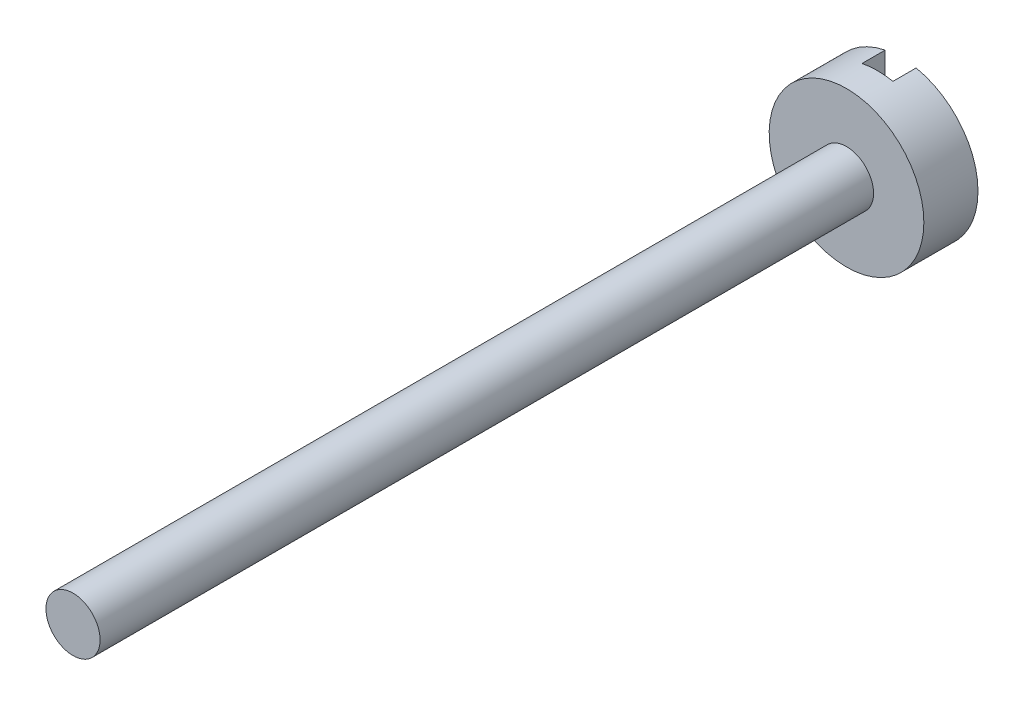
ISO-10303-21;
HEADER;
FILE_DESCRIPTION(('STEP AP214'),'2;1');
FILE_NAME('part.step','',(''),(''),'','','');
FILE_SCHEMA(('AUTOMOTIVE_DESIGN { 1 0 10303 214 1 1 1 1 }'));
ENDSEC;
DATA;
#1=APPLICATION_CONTEXT('core data for automotive mechanical design processes');
#2=APPLICATION_PROTOCOL_DEFINITION('international standard','automotive_design',2000,#1);
#3=PRODUCT_CONTEXT('',#1,'mechanical');
#4=PRODUCT('Part','Part','',(#3));
#5=PRODUCT_RELATED_PRODUCT_CATEGORY('part','',(#4));
#6=PRODUCT_DEFINITION_FORMATION('','',#4);
#7=PRODUCT_DEFINITION_CONTEXT('part definition',#1,'design');
#8=PRODUCT_DEFINITION('design','',#6,#7);
#9=PRODUCT_DEFINITION_SHAPE('','',#8);
#10=(LENGTH_UNIT() NAMED_UNIT(*) SI_UNIT(.MILLI.,.METRE.));
#11=(NAMED_UNIT(*) PLANE_ANGLE_UNIT() SI_UNIT($,.RADIAN.));
#12=(NAMED_UNIT(*) SI_UNIT($,.STERADIAN.) SOLID_ANGLE_UNIT());
#13=UNCERTAINTY_MEASURE_WITH_UNIT(LENGTH_MEASURE(1.E-05),#10,'distance_accuracy_value','');
#14=(GEOMETRIC_REPRESENTATION_CONTEXT(3) GLOBAL_UNCERTAINTY_ASSIGNED_CONTEXT((#13)) GLOBAL_UNIT_ASSIGNED_CONTEXT((#10,
#11,#12)) REPRESENTATION_CONTEXT('',''));
#15=CARTESIAN_POINT('',(0.,0.,0.));
#16=DIRECTION('',(0.,0.,1.));
#17=DIRECTION('',(1.,0.,0.));
#18=AXIS2_PLACEMENT_3D('',#15,#16,#17);
#19=CARTESIAN_POINT('',(0.,0.,0.));
#20=DIRECTION('',(0.,0.,1.));
#21=DIRECTION('',(1.,0.,0.));
#22=AXIS2_PLACEMENT_3D('',#19,#20,#21);
#23=PLANE('',#22);
#24=CARTESIAN_POINT('',(0.,0.,0.));
#25=DIRECTION('',(0.,0.,1.));
#26=DIRECTION('',(1.,0.,0.));
#27=AXIS2_PLACEMENT_3D('',#24,#25,#26);
#28=CIRCLE('',#27,1.);
#29=CARTESIAN_POINT('',(-0.2,0.979795897113271,0.));
#30=VERTEX_POINT('',#29);
#31=CARTESIAN_POINT('',(-0.2,-0.979795897113271,0.));
#32=VERTEX_POINT('',#31);
#33=EDGE_CURVE('E88',#30,#32,#28,.T.);
#34=ORIENTED_EDGE('',*,*,#33,.F.);
#35=DIRECTION('',(0.,-1.,0.));
#36=VECTOR('',#35,1.);
#37=CARTESIAN_POINT('',(-0.2,0.,0.));
#38=LINE('',#37,#36);
#39=EDGE_CURVE('E79',#30,#32,#38,.T.);
#40=ORIENTED_EDGE('',*,*,#39,.T.);
#41=EDGE_LOOP('',(#34,#40));
#42=FACE_BOUND('',#41,.T.);
#43=ADVANCED_FACE('F33',(#42),#23,.F.);
#44=CARTESIAN_POINT('',(0.,0.,0.7));
#45=DIRECTION('',(0.,0.,1.));
#46=DIRECTION('',(1.,0.,0.));
#47=AXIS2_PLACEMENT_3D('',#44,#45,#46);
#48=PLANE('',#47);
#49=CARTESIAN_POINT('',(0.,0.,0.7));
#50=DIRECTION('',(0.,0.,1.));
#51=DIRECTION('',(1.,0.,0.));
#52=AXIS2_PLACEMENT_3D('',#49,#50,#51);
#53=CIRCLE('',#52,1.);
#54=CARTESIAN_POINT('',(1.,0.,0.7));
#55=VERTEX_POINT('',#54);
#56=EDGE_CURVE('E80',#55,#55,#53,.T.);
#57=ORIENTED_EDGE('',*,*,#56,.T.);
#58=EDGE_LOOP('',(#57));
#59=FACE_BOUND('',#58,.T.);
#60=CARTESIAN_POINT('',(0.,0.,0.7));
#61=DIRECTION('',(0.,0.,1.));
#62=DIRECTION('',(1.,0.,0.));
#63=AXIS2_PLACEMENT_3D('',#60,#61,#62);
#64=CIRCLE('',#63,0.35);
#65=CARTESIAN_POINT('',(0.35,0.,0.7));
#66=VERTEX_POINT('',#65);
#67=EDGE_CURVE('E93',#66,#66,#64,.T.);
#68=ORIENTED_EDGE('',*,*,#67,.F.);
#69=EDGE_LOOP('',(#68));
#70=FACE_BOUND('',#69,.T.);
#71=ADVANCED_FACE('F118',(#59,#70),#48,.T.);
#72=CARTESIAN_POINT('',(0.,0.,0.7));
#73=DIRECTION('',(0.,0.,-1.));
#74=DIRECTION('',(-1.,0.,0.));
#75=AXIS2_PLACEMENT_3D('',#72,#73,#74);
#76=CYLINDRICAL_SURFACE('',#75,1.);
#77=CARTESIAN_POINT('',(0.,0.,0.3));
#78=DIRECTION('',(0.,0.,-1.));
#79=DIRECTION('',(-1.,0.,0.));
#80=AXIS2_PLACEMENT_3D('',#77,#78,#79);
#81=CIRCLE('',#80,1.);
#82=CARTESIAN_POINT('',(-0.2,0.979795897113271,0.3));
#83=VERTEX_POINT('',#82);
#84=CARTESIAN_POINT('',(0.2,0.979795897113271,0.3));
#85=VERTEX_POINT('',#84);
#86=EDGE_CURVE('E11',#83,#85,#81,.T.);
#87=ORIENTED_EDGE('',*,*,#86,.F.);
#88=DIRECTION('',(0.,0.,-1.));
#89=VECTOR('',#88,1.);
#90=CARTESIAN_POINT('',(-0.2,0.979795897113271,0.7));
#91=LINE('',#90,#89);
#92=EDGE_CURVE('E108',#83,#30,#91,.T.);
#93=ORIENTED_EDGE('',*,*,#92,.T.);
#94=ORIENTED_EDGE('',*,*,#33,.T.);
#95=DIRECTION('',(0.,0.,-1.));
#96=VECTOR('',#95,1.);
#97=CARTESIAN_POINT('',(-0.2,-0.979795897113271,0.7));
#98=LINE('',#97,#96);
#99=CARTESIAN_POINT('',(-0.2,-0.979795897113271,0.3));
#100=VERTEX_POINT('',#99);
#101=EDGE_CURVE('E85',#32,#100,#98,.F.);
#102=ORIENTED_EDGE('',*,*,#101,.T.);
#103=CARTESIAN_POINT('',(0.2,-0.979795897113271,0.3));
#104=VERTEX_POINT('',#103);
#105=EDGE_CURVE('E37',#104,#100,#81,.T.);
#106=ORIENTED_EDGE('',*,*,#105,.F.);
#107=DIRECTION('',(0.,0.,-1.));
#108=VECTOR('',#107,1.);
#109=CARTESIAN_POINT('',(0.2,-0.979795897113271,0.7));
#110=LINE('',#109,#108);
#111=CARTESIAN_POINT('',(0.2,-0.979795897113271,0.));
#112=VERTEX_POINT('',#111);
#113=EDGE_CURVE('E74',#104,#112,#110,.T.);
#114=ORIENTED_EDGE('',*,*,#113,.T.);
#115=CARTESIAN_POINT('',(0.2,0.979795897113271,0.));
#116=VERTEX_POINT('',#115);
#117=EDGE_CURVE('E83',#112,#116,#28,.T.);
#118=ORIENTED_EDGE('',*,*,#117,.T.);
#119=DIRECTION('',(0.,0.,-1.));
#120=VECTOR('',#119,1.);
#121=CARTESIAN_POINT('',(0.2,0.979795897113271,0.7));
#122=LINE('',#121,#120);
#123=EDGE_CURVE('E48',#116,#85,#122,.F.);
#124=ORIENTED_EDGE('',*,*,#123,.T.);
#125=EDGE_LOOP('',(#87,#93,#94,#102,#106,#114,#118,#124));
#126=FACE_BOUND('',#125,.T.);
#127=ORIENTED_EDGE('',*,*,#56,.F.);
#128=EDGE_LOOP('',(#127));
#129=FACE_BOUND('',#128,.T.);
#130=ADVANCED_FACE('F35',(#126,#129),#76,.T.);
#131=ORIENTED_EDGE('',*,*,#117,.F.);
#132=DIRECTION('',(0.,1.,0.));
#133=VECTOR('',#132,1.);
#134=CARTESIAN_POINT('',(0.2,0.,0.));
#135=LINE('',#134,#133);
#136=EDGE_CURVE('E71',#112,#116,#135,.T.);
#137=ORIENTED_EDGE('',*,*,#136,.T.);
#138=EDGE_LOOP('',(#131,#137));
#139=FACE_BOUND('',#138,.T.);
#140=ADVANCED_FACE('F87',(#139),#23,.F.);
#141=CARTESIAN_POINT('',(0.,0.,10.7));
#142=DIRECTION('',(0.,0.,-1.));
#143=DIRECTION('',(-1.,0.,0.));
#144=AXIS2_PLACEMENT_3D('',#141,#142,#143);
#145=CYLINDRICAL_SURFACE('',#144,0.35);
#146=CARTESIAN_POINT('',(0.,0.,10.7));
#147=DIRECTION('',(0.,0.,1.));
#148=DIRECTION('',(1.,0.,0.));
#149=AXIS2_PLACEMENT_3D('',#146,#147,#148);
#150=CIRCLE('',#149,0.35);
#151=CARTESIAN_POINT('',(0.35,0.,10.7));
#152=VERTEX_POINT('',#151);
#153=EDGE_CURVE('E89',#152,#152,#150,.T.);
#154=ORIENTED_EDGE('',*,*,#153,.F.);
#155=EDGE_LOOP('',(#154));
#156=FACE_BOUND('',#155,.T.);
#157=ORIENTED_EDGE('',*,*,#67,.T.);
#158=EDGE_LOOP('',(#157));
#159=FACE_BOUND('',#158,.T.);
#160=ADVANCED_FACE('F116',(#156,#159),#145,.T.);
#161=CARTESIAN_POINT('',(0.,0.,10.7));
#162=DIRECTION('',(0.,0.,1.));
#163=DIRECTION('',(1.,0.,0.));
#164=AXIS2_PLACEMENT_3D('',#161,#162,#163);
#165=PLANE('',#164);
#166=ORIENTED_EDGE('',*,*,#153,.T.);
#167=EDGE_LOOP('',(#166));
#168=FACE_BOUND('',#167,.T.);
#169=ADVANCED_FACE('F133',(#168),#165,.T.);
#170=CARTESIAN_POINT('',(-0.2,-1.,0.3));
#171=DIRECTION('',(0.,0.,-1.));
#172=DIRECTION('',(-1.,0.,0.));
#173=AXIS2_PLACEMENT_3D('',#170,#171,#172);
#174=PLANE('',#173);
#175=DIRECTION('',(0.,1.,0.));
#176=VECTOR('',#175,1.);
#177=CARTESIAN_POINT('',(-0.2,1.,0.3));
#178=LINE('',#177,#176);
#179=EDGE_CURVE('E104',#100,#83,#178,.T.);
#180=ORIENTED_EDGE('',*,*,#179,.T.);
#181=ORIENTED_EDGE('',*,*,#86,.T.);
#182=DIRECTION('',(0.,-1.,0.));
#183=VECTOR('',#182,1.);
#184=CARTESIAN_POINT('',(0.2,1.,0.3));
#185=LINE('',#184,#183);
#186=EDGE_CURVE('E105',#85,#104,#185,.T.);
#187=ORIENTED_EDGE('',*,*,#186,.T.);
#188=ORIENTED_EDGE('',*,*,#105,.T.);
#189=EDGE_LOOP('',(#180,#181,#187,#188));
#190=FACE_BOUND('',#189,.T.);
#191=ADVANCED_FACE('F103',(#190),#174,.T.);
#192=CARTESIAN_POINT('',(-0.2,1.,0.3));
#193=DIRECTION('',(-1.,0.,0.));
#194=DIRECTION('',(0.,-1.,0.));
#195=AXIS2_PLACEMENT_3D('',#192,#193,#194);
#196=PLANE('',#195);
#197=ORIENTED_EDGE('',*,*,#179,.F.);
#198=ORIENTED_EDGE('',*,*,#101,.F.);
#199=ORIENTED_EDGE('',*,*,#39,.F.);
#200=ORIENTED_EDGE('',*,*,#92,.F.);
#201=EDGE_LOOP('',(#197,#198,#199,#200));
#202=FACE_BOUND('',#201,.T.);
#203=ADVANCED_FACE('F107',(#202),#196,.F.);
#204=CARTESIAN_POINT('',(0.2,1.,0.3));
#205=DIRECTION('',(1.,0.,0.));
#206=DIRECTION('',(0.,1.,0.));
#207=AXIS2_PLACEMENT_3D('',#204,#205,#206);
#208=PLANE('',#207);
#209=ORIENTED_EDGE('',*,*,#186,.F.);
#210=ORIENTED_EDGE('',*,*,#123,.F.);
#211=ORIENTED_EDGE('',*,*,#136,.F.);
#212=ORIENTED_EDGE('',*,*,#113,.F.);
#213=EDGE_LOOP('',(#209,#210,#211,#212));
#214=FACE_BOUND('',#213,.T.);
#215=ADVANCED_FACE('F73',(#214),#208,.F.);
#216=CLOSED_SHELL('',(#43,#71,#130,#140,#160,#169,#191,#203,#215));
#217=MANIFOLD_SOLID_BREP('B2',#216);
#218=ADVANCED_BREP_SHAPE_REPRESENTATION('',(#18,#217),#14);
#219=SHAPE_DEFINITION_REPRESENTATION(#9,#218);
ENDSEC;
END-ISO-10303-21;
